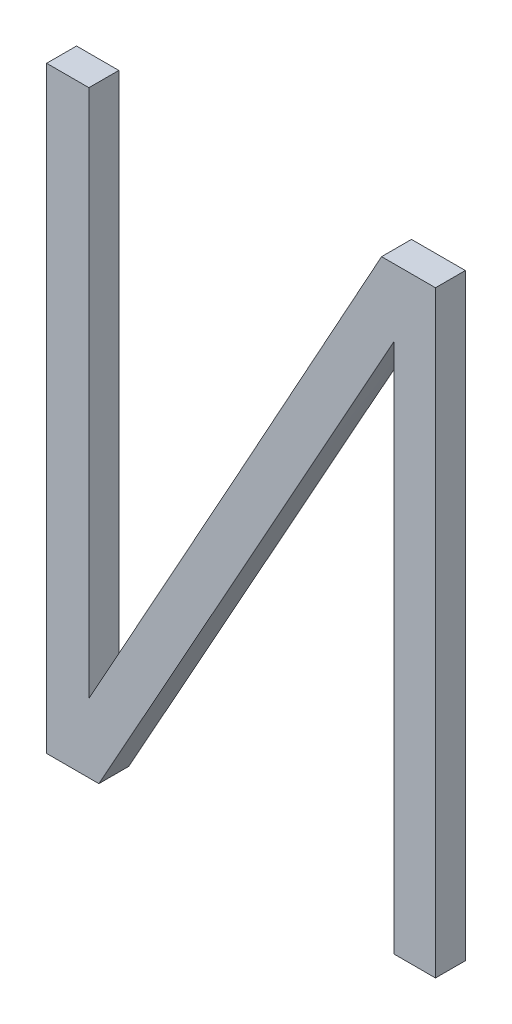
ISO-10303-21;
HEADER;
FILE_DESCRIPTION(('STEP AP214'),'2;1');
FILE_NAME('part.step','',(''),(''),'','','');
FILE_SCHEMA(('AUTOMOTIVE_DESIGN { 1 0 10303 214 1 1 1 1 }'));
ENDSEC;
DATA;
#1=APPLICATION_CONTEXT('core data for automotive mechanical design processes');
#2=APPLICATION_PROTOCOL_DEFINITION('international standard','automotive_design',2000,#1);
#3=PRODUCT_CONTEXT('',#1,'mechanical');
#4=PRODUCT('Part','Part','',(#3));
#5=PRODUCT_RELATED_PRODUCT_CATEGORY('part','',(#4));
#6=PRODUCT_DEFINITION_FORMATION('','',#4);
#7=PRODUCT_DEFINITION_CONTEXT('part definition',#1,'design');
#8=PRODUCT_DEFINITION('design','',#6,#7);
#9=PRODUCT_DEFINITION_SHAPE('','',#8);
#10=(LENGTH_UNIT() NAMED_UNIT(*) SI_UNIT(.MILLI.,.METRE.));
#11=(NAMED_UNIT(*) PLANE_ANGLE_UNIT() SI_UNIT($,.RADIAN.));
#12=(NAMED_UNIT(*) SI_UNIT($,.STERADIAN.) SOLID_ANGLE_UNIT());
#13=UNCERTAINTY_MEASURE_WITH_UNIT(LENGTH_MEASURE(1.E-05),#10,'distance_accuracy_value','');
#14=(GEOMETRIC_REPRESENTATION_CONTEXT(3) GLOBAL_UNCERTAINTY_ASSIGNED_CONTEXT((#13)) GLOBAL_UNIT_ASSIGNED_CONTEXT((#10,
#11,#12)) REPRESENTATION_CONTEXT('',''));
#15=CARTESIAN_POINT('',(0.,0.,0.));
#16=DIRECTION('',(0.,0.,1.));
#17=DIRECTION('',(1.,0.,0.));
#18=AXIS2_PLACEMENT_3D('',#15,#16,#17);
#19=CARTESIAN_POINT('',(62.1800517279475,66.6666929015237,-39.1));
#20=DIRECTION('',(0.,0.,1.));
#21=DIRECTION('',(1.,0.,0.));
#22=AXIS2_PLACEMENT_3D('',#19,#20,#21);
#23=PLANE('',#22);
#24=DIRECTION('',(1.,0.,0.));
#25=VECTOR('',#24,1.);
#26=CARTESIAN_POINT('',(62.1800517279475,67.7791772221511,-39.1));
#27=LINE('',#26,#25);
#28=CARTESIAN_POINT('',(61.6527362234903,67.7791772221511,-39.1));
#29=VERTEX_POINT('',#28);
#30=CARTESIAN_POINT('',(61.5112660431903,67.7791772221511,-39.1));
#31=VERTEX_POINT('',#30);
#32=EDGE_CURVE('E145',#29,#31,#27,.F.);
#33=ORIENTED_EDGE('',*,*,#32,.F.);
#34=DIRECTION('',(0.,1.,0.));
#35=VECTOR('',#34,1.);
#36=CARTESIAN_POINT('',(61.6527362234903,66.0094130057811,-39.1));
#37=LINE('',#36,#35);
#38=CARTESIAN_POINT('',(61.6527362234903,66.0094130057811,-39.1));
#39=VERTEX_POINT('',#38);
#40=EDGE_CURVE('E148',#29,#39,#37,.F.);
#41=ORIENTED_EDGE('',*,*,#40,.T.);
#42=CARTESIAN_POINT('',(61.6527362234903,66.0094130057811,-39.1));
#43=CARTESIAN_POINT('',(61.6606078385977,66.0241059692266,-39.1));
#44=CARTESIAN_POINT('',(61.668564429899,66.0387526503622,-39.1));
#45=CARTESIAN_POINT('',(61.6845801613504,66.067989588772,-39.1));
#46=CARTESIAN_POINT('',(61.6926392996061,66.082579847082,-39.1));
#47=CARTESIAN_POINT('',(61.7168698893097,66.1263210315515,-39.1));
#48=CARTESIAN_POINT('',(61.7330945019018,66.1554423420638,-39.1));
#49=CARTESIAN_POINT('',(61.8142467330982,66.3010206355289,-39.1));
#50=CARTESIAN_POINT('',(61.8792772472124,66.4174204914166,-39.1));
#51=CARTESIAN_POINT('',(61.9763765480157,66.5922684320205,-39.1));
#52=CARTESIAN_POINT('',(62.008668579641,66.650592456125,-39.1));
#53=CARTESIAN_POINT('',(62.0732446873764,66.767244945074,-39.1));
#54=CARTESIAN_POINT('',(62.1055287634749,66.8255734099249,-39.1));
#55=CARTESIAN_POINT('',(62.1584549916867,66.9211752142007,-39.1));
#56=CARTESIAN_POINT('',(62.1790938737639,66.9584503556178,-39.1));
#57=CARTESIAN_POINT('',(62.2203436657047,67.033016089576,-39.1));
#58=CARTESIAN_POINT('',(62.2409545755811,67.0703066821101,-39.1));
#59=CARTESIAN_POINT('',(62.3027673918121,67.1821895664193,-39.1));
#60=CARTESIAN_POINT('',(62.3439493388135,67.2567928818611,-39.1));
#61=CARTESIAN_POINT('',(62.4262864301125,67.4060144774013,-39.1));
#62=CARTESIAN_POINT('',(62.4674415743614,67.4806327575265,-39.1));
#63=CARTESIAN_POINT('',(62.5497158937783,67.6298889751678,-39.1));
#64=CARTESIAN_POINT('',(62.5908350690085,67.7045269126496,-39.1));
#65=CARTESIAN_POINT('',(62.6319317852903,67.7791772221511,-39.1));
#66=B_SPLINE_CURVE_WITH_KNOTS('',3,(#42,#43,#44,#45,#46,#47,#48,#49,#50,#51,#52,#53,#54,#55,#56,
#57,#58,#59,#60,#61,#62,#63,#64,#65),.UNSPECIFIED.,.F.,.F.,(4,2,2,2,2,2,2,2,2,2,2,4),(0.,
0.0500048945342751,0.100008866648671,0.200016897022536,0.600017373401318,0.800017733233071,
1.00001838333012,1.12784089293686,1.25566334450765,1.51130853237362,1.76695418296459,
2.02259938991576),.UNSPECIFIED.);
#67=CARTESIAN_POINT('',(62.6319317852903,67.7791772221511,-39.1));
#68=VERTEX_POINT('',#67);
#69=EDGE_CURVE('E233',#39,#68,#66,.T.);
#70=ORIENTED_EDGE('',*,*,#69,.T.);
#71=DIRECTION('',(1.,0.,0.));
#72=VECTOR('',#71,1.);
#73=CARTESIAN_POINT('',(62.8122369169903,67.7791772221511,-39.1));
#74=LINE('',#73,#72);
#75=CARTESIAN_POINT('',(62.8122369169903,67.7791772221511,-39.1));
#76=VERTEX_POINT('',#75);
#77=EDGE_CURVE('E157',#68,#76,#74,.T.);
#78=ORIENTED_EDGE('',*,*,#77,.T.);
#79=DIRECTION('',(0.,1.,0.));
#80=VECTOR('',#79,1.);
#81=CARTESIAN_POINT('',(62.8122369169903,65.7791772221511,-39.1));
#82=LINE('',#81,#80);
#83=CARTESIAN_POINT('',(62.8122369169903,65.7791772221511,-39.1));
#84=VERTEX_POINT('',#83);
#85=EDGE_CURVE('E164',#76,#84,#82,.F.);
#86=ORIENTED_EDGE('',*,*,#85,.T.);
#87=DIRECTION('',(1.,0.,0.));
#88=VECTOR('',#87,1.);
#89=CARTESIAN_POINT('',(62.6735406617903,65.7791772221511,-39.1));
#90=LINE('',#89,#88);
#91=CARTESIAN_POINT('',(62.6735406617903,65.7791772221511,-39.1));
#92=VERTEX_POINT('',#91);
#93=EDGE_CURVE('E170',#84,#92,#90,.F.);
#94=ORIENTED_EDGE('',*,*,#93,.T.);
#95=DIRECTION('',(0.,1.,0.));
#96=VECTOR('',#95,1.);
#97=CARTESIAN_POINT('',(62.6735406617903,67.5544892887211,-39.1));
#98=LINE('',#97,#96);
#99=CARTESIAN_POINT('',(62.6735406617903,67.5544892887211,-39.1));
#100=VERTEX_POINT('',#99);
#101=EDGE_CURVE('E115',#92,#100,#98,.T.);
#102=ORIENTED_EDGE('',*,*,#101,.T.);
#103=CARTESIAN_POINT('',(62.6735406617903,67.5544892887211,-39.1));
#104=CARTESIAN_POINT('',(62.6659856549262,67.539616104019,-39.1));
#105=CARTESIAN_POINT('',(62.6581871265861,67.5248726895325,-39.1));
#106=CARTESIAN_POINT('',(62.6423046867129,67.4955421530344,-39.1));
#107=CARTESIAN_POINT('',(62.6342208143779,67.4809550099118,-39.1));
#108=CARTESIAN_POINT('',(62.6179671824376,67.4518297796673,-39.1));
#109=CARTESIAN_POINT('',(62.6097974229762,67.4372916924633,-39.1));
#110=CARTESIAN_POINT('',(62.593429010234,67.4082308789857,-39.1));
#111=CARTESIAN_POINT('',(62.5852303558942,67.393708153301,-39.1));
#112=CARTESIAN_POINT('',(62.5443098822868,67.3211003299754,-39.1));
#113=CARTESIAN_POINT('',(62.511746256976,67.2629263122671,-39.1));
#114=CARTESIAN_POINT('',(62.4467572441678,67.1465018277761,-39.1));
#115=CARTESIAN_POINT('',(62.414331855558,67.0882513616135,-39.1));
#116=CARTESIAN_POINT('',(62.3496337862615,66.9716650529648,-39.1));
#117=CARTESIAN_POINT('',(62.3173611069384,66.9133292097224,-39.1));
#118=CARTESIAN_POINT('',(62.2526618216293,66.7967427898438,-39.1));
#119=CARTESIAN_POINT('',(62.220235215659,66.738492213199,-39.1));
#120=CARTESIAN_POINT('',(62.1666966881275,66.6428113232665,-39.1));
#121=CARTESIAN_POINT('',(62.1456594086362,66.6053392514314,-39.1));
#122=CARTESIAN_POINT('',(62.103733255907,66.5303121895803,-39.1));
#123=CARTESIAN_POINT('',(62.0828443825815,66.4927571996134,-39.1));
#124=CARTESIAN_POINT('',(62.0411024570009,66.4176275255709,-39.1));
#125=CARTESIAN_POINT('',(62.020249404665,66.3800528415401,-39.1));
#126=CARTESIAN_POINT('',(61.9785161833499,66.3049184688319,-39.1));
#127=CARTESIAN_POINT('',(61.9576360143481,66.267358780167,-39.1));
#128=CARTESIAN_POINT('',(61.9158559184384,66.1922503882254,-39.1));
#129=CARTESIAN_POINT('',(61.8949559915246,66.1547016849521,-39.1));
#130=CARTESIAN_POINT('',(61.8531506085761,66.0796073555219,-39.1));
#131=CARTESIAN_POINT('',(61.8322451525413,66.0420617293651,-39.1));
#132=CARTESIAN_POINT('',(61.7904410716406,65.9669666154978,-39.1));
#133=CARTESIAN_POINT('',(61.7695424467826,65.929417127783,-39.1));
#134=CARTESIAN_POINT('',(61.7277648970438,65.8543071840626,-39.1));
#135=CARTESIAN_POINT('',(61.7068859721679,65.8167467280543,-39.1));
#136=CARTESIAN_POINT('',(61.6860233247903,65.7791772221511,-39.1));
#137=B_SPLINE_CURVE_WITH_KNOTS('',3,(#103,#104,#105,#106,#107,#108,#109,#110,#111,#112,#113,
#114,#115,#116,#117,#118,#119,#120,#121,#122,#123,#124,#125,#126,#127,#128,#129,#130,#131,#132,
#133,#134,#135,#136),.UNSPECIFIED.,.F.,.F.,(4,2,2,2,2,2,2,2,2,2,2,2,2,2,2,2,4),(0.,
0.0500364226242366,0.100065998229997,0.150095490059501,0.200126835163697,0.400130022589796,
0.600131597323521,0.800134954449979,1.0001382913398,1.12905867742901,1.25797898734675,
1.38689900597529,1.5158191318673,1.64473929691005,1.77365946313913,1.90257977871914,
2.03150012646145),.UNSPECIFIED.);
#138=CARTESIAN_POINT('',(61.6860233247903,65.7791772221511,-39.1));
#139=VERTEX_POINT('',#138);
#140=EDGE_CURVE('E24',#100,#139,#137,.T.);
#141=ORIENTED_EDGE('',*,*,#140,.T.);
#142=DIRECTION('',(1.,0.,0.));
#143=VECTOR('',#142,1.);
#144=CARTESIAN_POINT('',(61.5112660431903,65.7791772221511,-39.1));
#145=LINE('',#144,#143);
#146=CARTESIAN_POINT('',(61.5112660431903,65.7791772221511,-39.1));
#147=VERTEX_POINT('',#146);
#148=EDGE_CURVE('E105',#139,#147,#145,.F.);
#149=ORIENTED_EDGE('',*,*,#148,.T.);
#150=DIRECTION('',(0.,1.,0.));
#151=VECTOR('',#150,1.);
#152=CARTESIAN_POINT('',(61.5112660431903,67.7791772221511,-39.1));
#153=LINE('',#152,#151);
#154=EDGE_CURVE('E132',#147,#31,#153,.T.);
#155=ORIENTED_EDGE('',*,*,#154,.T.);
#156=EDGE_LOOP('',(#33,#41,#70,#78,#86,#94,#102,#141,#149,#155));
#157=FACE_BOUND('',#156,.T.);
#158=ADVANCED_FACE('F17',(#157),#23,.F.);
#159=CARTESIAN_POINT('',(61.5112660431903,67.7791772221511,-39.));
#160=DIRECTION('',(1.,0.,0.));
#161=DIRECTION('',(0.,0.,-1.));
#162=AXIS2_PLACEMENT_3D('',#159,#160,#161);
#163=PLANE('',#162);
#164=DIRECTION('',(0.,0.,1.));
#165=VECTOR('',#164,1.);
#166=CARTESIAN_POINT('',(61.5112660431903,65.7791772221511,-39.));
#167=LINE('',#166,#165);
#168=CARTESIAN_POINT('',(61.5112660431903,65.7791772221511,-39.));
#169=VERTEX_POINT('',#168);
#170=EDGE_CURVE('E110',#147,#169,#167,.T.);
#171=ORIENTED_EDGE('',*,*,#170,.T.);
#172=DIRECTION('',(0.,1.,0.));
#173=VECTOR('',#172,1.);
#174=CARTESIAN_POINT('',(61.5112660431903,66.6666929015237,-39.));
#175=LINE('',#174,#173);
#176=CARTESIAN_POINT('',(61.5112660431903,67.7791772221511,-39.));
#177=VERTEX_POINT('',#176);
#178=EDGE_CURVE('E128',#177,#169,#175,.F.);
#179=ORIENTED_EDGE('',*,*,#178,.F.);
#180=DIRECTION('',(0.,0.,-1.));
#181=VECTOR('',#180,1.);
#182=CARTESIAN_POINT('',(61.5112660431903,67.7791772221511,-39.));
#183=LINE('',#182,#181);
#184=EDGE_CURVE('E137',#177,#31,#183,.T.);
#185=ORIENTED_EDGE('',*,*,#184,.T.);
#186=ORIENTED_EDGE('',*,*,#154,.F.);
#187=EDGE_LOOP('',(#171,#179,#185,#186));
#188=FACE_BOUND('',#187,.T.);
#189=ADVANCED_FACE('F224',(#188),#163,.F.);
#190=CARTESIAN_POINT('',(61.5112660431903,65.7791772221511,-39.));
#191=DIRECTION('',(0.,1.,0.));
#192=DIRECTION('',(0.,0.,1.));
#193=AXIS2_PLACEMENT_3D('',#190,#191,#192);
#194=PLANE('',#193);
#195=DIRECTION('',(0.,0.,1.));
#196=VECTOR('',#195,1.);
#197=CARTESIAN_POINT('',(61.6860233247903,65.7791772221511,-39.05));
#198=LINE('',#197,#196);
#199=CARTESIAN_POINT('',(61.6860233247903,65.7791772221511,-39.));
#200=VERTEX_POINT('',#199);
#201=EDGE_CURVE('E108',#139,#200,#198,.T.);
#202=ORIENTED_EDGE('',*,*,#201,.T.);
#203=DIRECTION('',(1.,0.,0.));
#204=VECTOR('',#203,1.);
#205=CARTESIAN_POINT('',(62.1800517279475,65.7791772221511,-39.));
#206=LINE('',#205,#204);
#207=EDGE_CURVE('E126',#169,#200,#206,.T.);
#208=ORIENTED_EDGE('',*,*,#207,.F.);
#209=ORIENTED_EDGE('',*,*,#170,.F.);
#210=ORIENTED_EDGE('',*,*,#148,.F.);
#211=EDGE_LOOP('',(#202,#208,#209,#210));
#212=FACE_BOUND('',#211,.T.);
#213=ADVANCED_FACE('F106',(#212),#194,.F.);
#214=CARTESIAN_POINT('',(61.6860233247903,65.7791772221511,-39.));
#215=CARTESIAN_POINT('',(61.6860233247903,65.7791772221511,-39.1));
#216=CARTESIAN_POINT('',(61.7392740010903,65.8750710151511,-39.));
#217=CARTESIAN_POINT('',(61.7392740010903,65.8750710151511,-39.1));
#218=CARTESIAN_POINT('',(61.8428995182903,66.0611955455411,-39.));
#219=CARTESIAN_POINT('',(61.8428995182903,66.0611955455411,-39.1));
#220=CARTESIAN_POINT('',(61.9937048269903,66.3320660251411,-39.));
#221=CARTESIAN_POINT('',(61.9937048269903,66.3320660251411,-39.1));
#222=CARTESIAN_POINT('',(62.1102855232903,66.5424096599711,-39.));
#223=CARTESIAN_POINT('',(62.1102855232903,66.5424096599711,-39.1));
#224=CARTESIAN_POINT('',(62.1969626691903,66.6967622067312,-39.));
#225=CARTESIAN_POINT('',(62.1969626691903,66.6967622067312,-39.1));
#226=CARTESIAN_POINT('',(62.2551937379903,66.8012589920711,-39.));
#227=CARTESIAN_POINT('',(62.2551937379903,66.8012589920711,-39.1));
#228=CARTESIAN_POINT('',(62.3123953168903,66.9043981850211,-39.));
#229=CARTESIAN_POINT('',(62.3123953168903,66.9043981850211,-39.1));
#230=CARTESIAN_POINT('',(62.3678888322903,67.0046163553611,-39.));
#231=CARTESIAN_POINT('',(62.3678888322903,67.0046163553611,-39.1));
#232=CARTESIAN_POINT('',(62.4210619755903,67.1003133886411,-39.));
#233=CARTESIAN_POINT('',(62.4210619755903,67.1003133886411,-39.1));
#234=CARTESIAN_POINT('',(62.4711900301903,67.1903164341511,-39.));
#235=CARTESIAN_POINT('',(62.4711900301903,67.1903164341511,-39.1));
#236=CARTESIAN_POINT('',(62.5177813464903,67.2736885987511,-39.));
#237=CARTESIAN_POINT('',(62.5177813464903,67.2736885987511,-39.1));
#238=CARTESIAN_POINT('',(62.5602869097903,67.3495250564411,-39.));
#239=CARTESIAN_POINT('',(62.5602869097903,67.3495250564411,-39.1));
#240=CARTESIAN_POINT('',(62.5980963663903,67.4164740667511,-39.));
#241=CARTESIAN_POINT('',(62.5980963663903,67.4164740667511,-39.1));
#242=CARTESIAN_POINT('',(62.6299266943903,67.4730811253211,-39.));
#243=CARTESIAN_POINT('',(62.6299266943903,67.4730811253211,-39.1));
#244=CARTESIAN_POINT('',(62.6545510938903,67.5178676464511,-39.));
#245=CARTESIAN_POINT('',(62.6545510938903,67.5178676464511,-39.1));
#246=CARTESIAN_POINT('',(62.6680617870903,67.5436895612411,-39.));
#247=CARTESIAN_POINT('',(62.6680617870903,67.5436895612411,-39.1));
#248=CARTESIAN_POINT('',(62.6735406617903,67.5544892887211,-39.));
#249=CARTESIAN_POINT('',(62.6735406617903,67.5544892887211,-39.1));
#250=B_SPLINE_SURFACE_WITH_KNOTS('',3,1,((#214,#215),(#216,#217),(#218,#219),(#220,#221),(#222,
#223),(#224,#225),(#226,#227),(#228,#229),(#230,#231),(#232,#233),(#234,#235),(#236,#237),(#238,
#239),(#240,#241),(#242,#243),(#244,#245),(#246,#247),(#248,#249)),.UNSPECIFIED.,.F.,.F.,.F.,(4,
1,1,1,1,1,1,1,1,1,1,1,1,1,1,4),(2,2),(0.,0.1619791360498,0.314586119726,0.4578209512225,
0.517119340157,0.5760048260433,0.6344776424312,0.691285303693,0.7451751883624,0.7961473611019,
0.84342088792,0.8862148614467,0.92452942342535,0.95696377389063,0.98211890272251,1.),(1.,1.1),.UNSPECIFIED.);
#251=DIRECTION('',(0.,0.,-1.));
#252=VECTOR('',#251,1.);
#253=CARTESIAN_POINT('',(62.6735406617903,67.5544892887211,-39.));
#254=LINE('',#253,#252);
#255=CARTESIAN_POINT('',(62.6735406617903,67.5544892887211,-39.));
#256=VERTEX_POINT('',#255);
#257=EDGE_CURVE('E117',#100,#256,#254,.F.);
#258=CARTESIAN_POINT('',(61.6860233247903,65.7791772221511,-39.));
#259=CARTESIAN_POINT('',(61.7183900195447,65.837459689315,-39.));
#260=CARTESIAN_POINT('',(61.7507935829092,65.8957216335472,-39.));
#261=CARTESIAN_POINT('',(61.8156311817095,66.012228560701,-39.));
#262=CARTESIAN_POINT('',(61.848065217142,66.0704735436245,-39.));
#263=CARTESIAN_POINT('',(61.9129205015195,66.1869706445384,-39.));
#264=CARTESIAN_POINT('',(61.9453417504647,66.2452227625288,-39.));
#265=CARTESIAN_POINT('',(62.0101017340244,66.361772876056,-39.));
#266=CARTESIAN_POINT('',(62.0424404685917,66.4200708716191,-39.));
#267=CARTESIAN_POINT('',(62.0910371447195,66.5074687178231,-39.));
#268=CARTESIAN_POINT('',(62.1072508006558,66.5365931447446,-39.));
#269=CARTESIAN_POINT('',(62.1397613498288,66.5947955301841,-39.));
#270=CARTESIAN_POINT('',(62.1560582431486,66.6238734886556,-39.));
#271=CARTESIAN_POINT('',(62.1828566163973,66.6716999897548,-39.));
#272=CARTESIAN_POINT('',(62.1933597859594,66.6904475920111,-39.));
#273=CARTESIAN_POINT('',(62.2143303956411,66.7279627555647,-39.));
#274=CARTESIAN_POINT('',(62.2247978357959,66.7467303168423,-39.));
#275=CARTESIAN_POINT('',(62.2561644558849,66.8030528444616,-39.));
#276=CARTESIAN_POINT('',(62.2770279459838,66.8406276734024,-39.));
#277=CARTESIAN_POINT('',(62.3187068486319,66.9158039657227,-39.));
#278=CARTESIAN_POINT('',(62.3395222611749,66.9534054291057,-39.));
#279=CARTESIAN_POINT('',(62.3812071115936,67.0285783709688,-39.));
#280=CARTESIAN_POINT('',(62.4020765494255,67.0661498494732,-39.));
#281=CARTESIAN_POINT('',(62.4438648962766,67.1412654157378,-39.));
#282=CARTESIAN_POINT('',(62.4647838054198,67.178809503429,-39.));
#283=CARTESIAN_POINT('',(62.4962165889214,67.2350952187693,-39.));
#284=CARTESIAN_POINT('',(62.5067032486261,67.253852046031,-39.));
#285=CARTESIAN_POINT('',(62.5276906369106,67.2913579090591,-39.));
#286=CARTESIAN_POINT('',(62.5381913655333,67.3101069448015,-39.));
#287=CARTESIAN_POINT('',(62.5592379225274,67.3475804909475,-39.));
#288=CARTESIAN_POINT('',(62.5697837523045,67.3663050005624,-39.));
#289=CARTESIAN_POINT('',(62.5908922592148,67.4037438978913,-39.));
#290=CARTESIAN_POINT('',(62.6014549360024,67.4224582858024,-39.));
#291=CARTESIAN_POINT('',(62.6225117702951,67.4599265350846,-39.));
#292=CARTESIAN_POINT('',(62.633005926559,67.4786803971625,-39.));
#293=CARTESIAN_POINT('',(62.6484963075756,67.5069507879096,-39.));
#294=CARTESIAN_POINT('',(62.6536181574609,67.5163978957487,-39.));
#295=CARTESIAN_POINT('',(62.66371032841,67.5353739103614,-39.));
#296=CARTESIAN_POINT('',(62.6686806314544,67.5449028266911,-39.));
#297=CARTESIAN_POINT('',(62.6735406617903,67.5544892887211,-39.));
#298=B_SPLINE_CURVE_WITH_KNOTS('',3,(#258,#259,#260,#261,#262,#263,#264,#265,#266,#267,#268,
#269,#270,#271,#272,#273,#274,#275,#276,#277,#278,#279,#280,#281,#282,#283,#284,#285,#286,#287,
#288,#289,#290,#291,#292,#293,#294,#295,#296,#297),.UNSPECIFIED.,.F.,.F.,(4,2,2,2,2,2,2,2,2,2,2,
2,2,2,2,2,2,2,2,4),(0.,0.200000028553227,0.400000035734633,0.600000040782703,0.800000160344116,
0.900000238752921,1.00000041703691,1.06446824939893,1.12893601844821,1.25787149185405,
1.38680698224136,1.51574236833355,1.64467807787353,1.70914587426554,1.7736138673501,
1.83808388474329,1.90255259649333,1.96702247280527,1.99925997182678,2.03150128915154),.UNSPECIFIED.);
#299=EDGE_CURVE('E120',#200,#256,#298,.T.);
#300=ORIENTED_EDGE('',*,*,#257,.T.);
#301=ORIENTED_EDGE('',*,*,#299,.F.);
#302=ORIENTED_EDGE('',*,*,#201,.F.);
#303=ORIENTED_EDGE('',*,*,#140,.F.);
#304=EDGE_LOOP('',(#300,#301,#302,#303));
#305=FACE_BOUND('',#304,.T.);
#306=ADVANCED_FACE('F118',(#305),#250,.F.);
#307=CARTESIAN_POINT('',(62.6735406617903,67.5544892887211,-39.));
#308=DIRECTION('',(1.,0.,0.));
#309=DIRECTION('',(0.,0.,-1.));
#310=AXIS2_PLACEMENT_3D('',#307,#308,#309);
#311=PLANE('',#310);
#312=DIRECTION('',(0.,0.,1.));
#313=VECTOR('',#312,1.);
#314=CARTESIAN_POINT('',(62.6735406617903,65.7791772221511,-39.));
#315=LINE('',#314,#313);
#316=CARTESIAN_POINT('',(62.6735406617903,65.7791772221511,-39.));
#317=VERTEX_POINT('',#316);
#318=EDGE_CURVE('E172',#92,#317,#315,.T.);
#319=ORIENTED_EDGE('',*,*,#318,.T.);
#320=DIRECTION('',(0.,1.,0.));
#321=VECTOR('',#320,1.);
#322=CARTESIAN_POINT('',(62.6735406617903,66.6666929015237,-39.));
#323=LINE('',#322,#321);
#324=EDGE_CURVE('E262',#256,#317,#323,.F.);
#325=ORIENTED_EDGE('',*,*,#324,.F.);
#326=ORIENTED_EDGE('',*,*,#257,.F.);
#327=ORIENTED_EDGE('',*,*,#101,.F.);
#328=EDGE_LOOP('',(#319,#325,#326,#327));
#329=FACE_BOUND('',#328,.T.);
#330=ADVANCED_FACE('F217',(#329),#311,.F.);
#331=CARTESIAN_POINT('',(62.6735406617903,65.7791772221511,-39.));
#332=DIRECTION('',(0.,1.,0.));
#333=DIRECTION('',(0.,0.,1.));
#334=AXIS2_PLACEMENT_3D('',#331,#332,#333);
#335=PLANE('',#334);
#336=DIRECTION('',(0.,0.,1.));
#337=VECTOR('',#336,1.);
#338=CARTESIAN_POINT('',(62.8122369169903,65.7791772221511,-39.));
#339=LINE('',#338,#337);
#340=CARTESIAN_POINT('',(62.8122369169903,65.7791772221511,-39.));
#341=VERTEX_POINT('',#340);
#342=EDGE_CURVE('E167',#84,#341,#339,.T.);
#343=ORIENTED_EDGE('',*,*,#342,.T.);
#344=DIRECTION('',(1.,0.,0.));
#345=VECTOR('',#344,1.);
#346=CARTESIAN_POINT('',(62.1800517279475,65.7791772221511,-39.));
#347=LINE('',#346,#345);
#348=EDGE_CURVE('E254',#317,#341,#347,.T.);
#349=ORIENTED_EDGE('',*,*,#348,.F.);
#350=ORIENTED_EDGE('',*,*,#318,.F.);
#351=ORIENTED_EDGE('',*,*,#93,.F.);
#352=EDGE_LOOP('',(#343,#349,#350,#351));
#353=FACE_BOUND('',#352,.T.);
#354=ADVANCED_FACE('F213',(#353),#335,.F.);
#355=CARTESIAN_POINT('',(62.8122369169903,65.7791772221511,-39.));
#356=DIRECTION('',(-1.,0.,0.));
#357=DIRECTION('',(0.,0.,1.));
#358=AXIS2_PLACEMENT_3D('',#355,#356,#357);
#359=PLANE('',#358);
#360=DIRECTION('',(0.,0.,-1.));
#361=VECTOR('',#360,1.);
#362=CARTESIAN_POINT('',(62.8122369169903,67.7791772221511,-39.));
#363=LINE('',#362,#361);
#364=CARTESIAN_POINT('',(62.8122369169903,67.7791772221511,-39.));
#365=VERTEX_POINT('',#364);
#366=EDGE_CURVE('E161',#76,#365,#363,.F.);
#367=ORIENTED_EDGE('',*,*,#366,.T.);
#368=DIRECTION('',(0.,1.,0.));
#369=VECTOR('',#368,1.);
#370=CARTESIAN_POINT('',(62.8122369169903,66.6666929015237,-39.));
#371=LINE('',#370,#369);
#372=EDGE_CURVE('E251',#341,#365,#371,.T.);
#373=ORIENTED_EDGE('',*,*,#372,.F.);
#374=ORIENTED_EDGE('',*,*,#342,.F.);
#375=ORIENTED_EDGE('',*,*,#85,.F.);
#376=EDGE_LOOP('',(#367,#373,#374,#375));
#377=FACE_BOUND('',#376,.T.);
#378=ADVANCED_FACE('F209',(#377),#359,.F.);
#379=CARTESIAN_POINT('',(62.8122369169903,67.7791772221511,-39.));
#380=DIRECTION('',(0.,-1.,0.));
#381=DIRECTION('',(0.,0.,-1.));
#382=AXIS2_PLACEMENT_3D('',#379,#380,#381);
#383=PLANE('',#382);
#384=DIRECTION('',(0.,0.,1.));
#385=VECTOR('',#384,1.);
#386=CARTESIAN_POINT('',(62.6319317852903,67.7791772221511,-39.05));
#387=LINE('',#386,#385);
#388=CARTESIAN_POINT('',(62.6319317852903,67.7791772221511,-39.));
#389=VERTEX_POINT('',#388);
#390=EDGE_CURVE('E160',#68,#389,#387,.T.);
#391=ORIENTED_EDGE('',*,*,#390,.T.);
#392=DIRECTION('',(1.,0.,0.));
#393=VECTOR('',#392,1.);
#394=CARTESIAN_POINT('',(62.1800517279475,67.7791772221511,-39.));
#395=LINE('',#394,#393);
#396=EDGE_CURVE('E188',#365,#389,#395,.F.);
#397=ORIENTED_EDGE('',*,*,#396,.F.);
#398=ORIENTED_EDGE('',*,*,#366,.F.);
#399=ORIENTED_EDGE('',*,*,#77,.F.);
#400=EDGE_LOOP('',(#391,#397,#398,#399));
#401=FACE_BOUND('',#400,.T.);
#402=ADVANCED_FACE('F206',(#401),#383,.F.);
#403=CARTESIAN_POINT('',(62.6319317852903,67.7791772221511,-39.));
#404=CARTESIAN_POINT('',(62.6319317852903,67.7791772221511,-39.1));
#405=CARTESIAN_POINT('',(62.5797720679903,67.6844356329711,-39.));
#406=CARTESIAN_POINT('',(62.5797720679903,67.6844356329711,-39.1));
#407=CARTESIAN_POINT('',(62.4783150144903,67.5003026980511,-39.));
#408=CARTESIAN_POINT('',(62.4783150144903,67.5003026980511,-39.1));
#409=CARTESIAN_POINT('',(62.3303681421903,67.2321588749211,-39.));
#410=CARTESIAN_POINT('',(62.3303681421903,67.2321588749211,-39.1));
#411=CARTESIAN_POINT('',(62.2155138433903,67.0242134116511,-39.));
#412=CARTESIAN_POINT('',(62.2155138433903,67.0242134116511,-39.1));
#413=CARTESIAN_POINT('',(62.1307736198903,66.8711803787111,-39.));
#414=CARTESIAN_POINT('',(62.1307736198903,66.8711803787111,-39.1));
#415=CARTESIAN_POINT('',(62.0734467994903,66.7676199748911,-39.));
#416=CARTESIAN_POINT('',(62.0734467994903,66.7676199748911,-39.1));
#417=CARTESIAN_POINT('',(62.0166067578903,66.6649192993611,-39.));
#418=CARTESIAN_POINT('',(62.0166067578903,66.6649192993611,-39.1));
#419=CARTESIAN_POINT('',(61.9611563077903,66.5648369337011,-39.));
#420=CARTESIAN_POINT('',(61.9611563077903,66.5648369337011,-39.1));
#421=CARTESIAN_POINT('',(61.9079934368903,66.4691341930611,-39.));
#422=CARTESIAN_POINT('',(61.9079934368903,66.4691341930611,-39.1));
#423=CARTESIAN_POINT('',(61.8578269187903,66.3791012417811,-39.));
#424=CARTESIAN_POINT('',(61.8578269187903,66.3791012417811,-39.1));
#425=CARTESIAN_POINT('',(61.8111990654903,66.2955440812411,-39.));
#426=CARTESIAN_POINT('',(61.8111990654903,66.2955440812411,-39.1));
#427=CARTESIAN_POINT('',(61.7686732404903,66.2192568601611,-39.));
#428=CARTESIAN_POINT('',(61.7686732404903,66.2192568601611,-39.1));
#429=CARTESIAN_POINT('',(61.7308733780903,66.1514740691311,-39.));
#430=CARTESIAN_POINT('',(61.7308733780903,66.1514740691311,-39.1));
#431=CARTESIAN_POINT('',(61.6987662792903,66.0937131686911,-39.));
#432=CARTESIAN_POINT('',(61.6987662792903,66.0937131686911,-39.1));
#433=CARTESIAN_POINT('',(61.6732963818903,66.0475032570011,-39.));
#434=CARTESIAN_POINT('',(61.6732963818903,66.0475032570011,-39.1));
#435=CARTESIAN_POINT('',(61.6588028375903,66.0207393393111,-39.));
#436=CARTESIAN_POINT('',(61.6588028375903,66.0207393393111,-39.1));
#437=CARTESIAN_POINT('',(61.6527362234903,66.0094130057811,-39.));
#438=CARTESIAN_POINT('',(61.6527362234903,66.0094130057811,-39.1));
#439=B_SPLINE_SURFACE_WITH_KNOTS('',3,1,((#403,#404),(#405,#406),(#407,#408),(#409,#410),(#411,
#412),(#413,#414),(#415,#416),(#417,#418),(#419,#420),(#421,#422),(#423,#424),(#425,#426),(#427,
#428),(#429,#430),(#431,#432),(#433,#434),(#435,#436),(#437,#438)),.UNSPECIFIED.,.F.,.F.,.F.,(4,
1,1,1,1,1,1,1,1,1,1,1,1,1,1,4),(2,2),(0.,0.1604136079313,0.3118279074916,0.4542429547996,
0.5127659514206,0.5712889480415,0.6298119446625,0.6868696112471,0.7409966603715,0.7921931569825,
0.8397412565589,0.8829230595845,0.92173856758161,0.95485567872177,0.98094257721977,1.),(1.,1.1),.UNSPECIFIED.);
#440=DIRECTION('',(0.,0.,1.));
#441=VECTOR('',#440,1.);
#442=CARTESIAN_POINT('',(61.6527362234903,66.0094130057811,-39.));
#443=LINE('',#442,#441);
#444=CARTESIAN_POINT('',(61.6527362234903,66.0094130057811,-39.));
#445=VERTEX_POINT('',#444);
#446=EDGE_CURVE('E151',#39,#445,#443,.T.);
#447=CARTESIAN_POINT('',(62.6319317852903,67.7791772221511,-39.));
#448=CARTESIAN_POINT('',(62.5997755675631,67.7207784148741,-39.));
#449=CARTESIAN_POINT('',(62.5676117239698,67.662383789083,-39.));
#450=CARTESIAN_POINT('',(62.4067439147423,67.3704373036958,-39.));
#451=CARTESIAN_POINT('',(62.2778942935699,67.1369655896198,-39.));
#452=CARTESIAN_POINT('',(62.1281221042737,66.866375018602,-39.));
#453=CARTESIAN_POINT('',(62.1074809376254,66.8291004145128,-39.));
#454=CARTESIAN_POINT('',(62.0662097082682,66.7545450561544,-39.));
#455=CARTESIAN_POINT('',(62.0455796455625,66.7172643018836,-39.));
#456=CARTESIAN_POINT('',(61.9836624381776,66.6054369385658,-39.));
#457=CARTESIAN_POINT('',(61.9423482732753,66.5309052272838,-39.));
#458=CARTESIAN_POINT('',(61.880184757327,66.4192145943376,-39.));
#459=CARTESIAN_POINT('',(61.8594315286554,66.3820021844352,-39.));
#460=CARTESIAN_POINT('',(61.8179242070572,66.3075777762284,-39.));
#461=CARTESIAN_POINT('',(61.7971701141289,66.270365777925,-39.));
#462=CARTESIAN_POINT('',(61.7660419462962,66.2145460265778,-39.));
#463=CARTESIAN_POINT('',(61.7556663715898,66.1959391253287,-39.));
#464=CARTESIAN_POINT('',(61.7349255092227,66.1587197430142,-39.));
#465=CARTESIAN_POINT('',(61.7245602215168,66.1401072619738,-39.));
#466=CARTESIAN_POINT('',(61.7038623690441,66.1028637020771,-39.));
#467=CARTESIAN_POINT('',(61.693529804557,66.0842326230637,-39.));
#468=CARTESIAN_POINT('',(61.6730029039451,66.0468942631212,-39.));
#469=CARTESIAN_POINT('',(61.6628085699821,66.0281869810063,-39.));
#470=CARTESIAN_POINT('',(61.6527362234903,66.0094130057811,-39.));
#471=B_SPLINE_CURVE_WITH_KNOTS('',3,(#447,#448,#449,#450,#451,#452,#453,#454,#455,#456,#457,
#458,#459,#460,#461,#462,#463,#464,#465,#466,#467,#468,#469,#470),.UNSPECIFIED.,.F.,.F.,(4,2,2,
2,2,2,2,2,2,2,2,4),(0.,0.20000000428509,1.00000026663447,1.12782468990855,1.25564914913963,
1.51129806167324,1.63912266413623,1.76694752209103,1.83086012384446,1.89477244290788,
1.95868530662293,2.02259916868413),.UNSPECIFIED.);
#472=EDGE_CURVE('E180',#389,#445,#471,.T.);
#473=ORIENTED_EDGE('',*,*,#446,.T.);
#474=ORIENTED_EDGE('',*,*,#472,.F.);
#475=ORIENTED_EDGE('',*,*,#390,.F.);
#476=ORIENTED_EDGE('',*,*,#69,.F.);
#477=EDGE_LOOP('',(#473,#474,#475,#476));
#478=FACE_BOUND('',#477,.T.);
#479=ADVANCED_FACE('F19',(#478),#439,.F.);
#480=CARTESIAN_POINT('',(61.6527362234903,66.0094130057811,-39.));
#481=DIRECTION('',(-1.,0.,0.));
#482=DIRECTION('',(0.,0.,1.));
#483=AXIS2_PLACEMENT_3D('',#480,#481,#482);
#484=PLANE('',#483);
#485=DIRECTION('',(0.,0.,-1.));
#486=VECTOR('',#485,1.);
#487=CARTESIAN_POINT('',(61.6527362234903,67.7791772221511,-39.));
#488=LINE('',#487,#486);
#489=CARTESIAN_POINT('',(61.6527362234903,67.7791772221511,-39.));
#490=VERTEX_POINT('',#489);
#491=EDGE_CURVE('E44',#29,#490,#488,.F.);
#492=ORIENTED_EDGE('',*,*,#491,.T.);
#493=DIRECTION('',(0.,1.,0.));
#494=VECTOR('',#493,1.);
#495=CARTESIAN_POINT('',(61.6527362234903,66.6666929015237,-39.));
#496=LINE('',#495,#494);
#497=EDGE_CURVE('E35',#445,#490,#496,.T.);
#498=ORIENTED_EDGE('',*,*,#497,.F.);
#499=ORIENTED_EDGE('',*,*,#446,.F.);
#500=ORIENTED_EDGE('',*,*,#40,.F.);
#501=EDGE_LOOP('',(#492,#498,#499,#500));
#502=FACE_BOUND('',#501,.T.);
#503=ADVANCED_FACE('F202',(#502),#484,.F.);
#504=CARTESIAN_POINT('',(61.6527362234903,67.7791772221511,-39.));
#505=DIRECTION('',(0.,-1.,0.));
#506=DIRECTION('',(0.,0.,-1.));
#507=AXIS2_PLACEMENT_3D('',#504,#505,#506);
#508=PLANE('',#507);
#509=ORIENTED_EDGE('',*,*,#184,.F.);
#510=DIRECTION('',(1.,0.,0.));
#511=VECTOR('',#510,1.);
#512=CARTESIAN_POINT('',(62.1800517279475,67.7791772221511,-39.));
#513=LINE('',#512,#511);
#514=EDGE_CURVE('E11',#490,#177,#513,.F.);
#515=ORIENTED_EDGE('',*,*,#514,.F.);
#516=ORIENTED_EDGE('',*,*,#491,.F.);
#517=ORIENTED_EDGE('',*,*,#32,.T.);
#518=EDGE_LOOP('',(#509,#515,#516,#517));
#519=FACE_BOUND('',#518,.T.);
#520=ADVANCED_FACE('F197',(#519),#508,.F.);
#521=CARTESIAN_POINT('',(62.1800517279475,66.6666929015237,-39.));
#522=DIRECTION('',(0.,0.,1.));
#523=DIRECTION('',(1.,0.,0.));
#524=AXIS2_PLACEMENT_3D('',#521,#522,#523);
#525=PLANE('',#524);
#526=ORIENTED_EDGE('',*,*,#497,.T.);
#527=ORIENTED_EDGE('',*,*,#514,.T.);
#528=ORIENTED_EDGE('',*,*,#178,.T.);
#529=ORIENTED_EDGE('',*,*,#207,.T.);
#530=ORIENTED_EDGE('',*,*,#299,.T.);
#531=ORIENTED_EDGE('',*,*,#324,.T.);
#532=ORIENTED_EDGE('',*,*,#348,.T.);
#533=ORIENTED_EDGE('',*,*,#372,.T.);
#534=ORIENTED_EDGE('',*,*,#396,.T.);
#535=ORIENTED_EDGE('',*,*,#472,.T.);
#536=EDGE_LOOP('',(#526,#527,#528,#529,#530,#531,#532,#533,#534,#535));
#537=FACE_BOUND('',#536,.T.);
#538=ADVANCED_FACE('F193',(#537),#525,.T.);
#539=CLOSED_SHELL('',(#158,#189,#213,#306,#330,#354,#378,#402,#479,#503,#520,#538));
#540=MANIFOLD_SOLID_BREP('B1',#539);
#541=ADVANCED_BREP_SHAPE_REPRESENTATION('',(#18,#540),#14);
#542=SHAPE_DEFINITION_REPRESENTATION(#9,#541);
ENDSEC;
END-ISO-10303-21;
